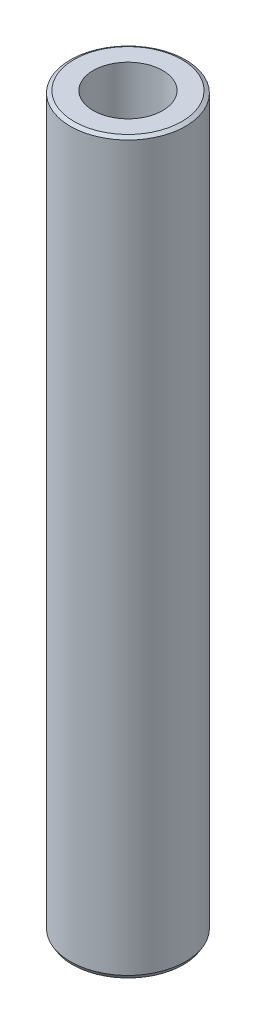
ISO-10303-21;
HEADER;
FILE_DESCRIPTION(('STEP AP214'),'2;1');
FILE_NAME('part.step','',(''),(''),'','','');
FILE_SCHEMA(('AUTOMOTIVE_DESIGN { 1 0 10303 214 1 1 1 1 }'));
ENDSEC;
DATA;
#1=APPLICATION_CONTEXT('core data for automotive mechanical design processes');
#2=APPLICATION_PROTOCOL_DEFINITION('international standard','automotive_design',2000,#1);
#3=PRODUCT_CONTEXT('',#1,'mechanical');
#4=PRODUCT('Part','Part','',(#3));
#5=PRODUCT_RELATED_PRODUCT_CATEGORY('part','',(#4));
#6=PRODUCT_DEFINITION_FORMATION('','',#4);
#7=PRODUCT_DEFINITION_CONTEXT('part definition',#1,'design');
#8=PRODUCT_DEFINITION('design','',#6,#7);
#9=PRODUCT_DEFINITION_SHAPE('','',#8);
#10=(LENGTH_UNIT() NAMED_UNIT(*) SI_UNIT(.MILLI.,.METRE.));
#11=(NAMED_UNIT(*) PLANE_ANGLE_UNIT() SI_UNIT($,.RADIAN.));
#12=(NAMED_UNIT(*) SI_UNIT($,.STERADIAN.) SOLID_ANGLE_UNIT());
#13=UNCERTAINTY_MEASURE_WITH_UNIT(LENGTH_MEASURE(1.E-05),#10,'distance_accuracy_value','');
#14=(GEOMETRIC_REPRESENTATION_CONTEXT(3) GLOBAL_UNCERTAINTY_ASSIGNED_CONTEXT((#13)) GLOBAL_UNIT_ASSIGNED_CONTEXT((#10,
#11,#12)) REPRESENTATION_CONTEXT('',''));
#15=CARTESIAN_POINT('',(0.,0.,0.));
#16=DIRECTION('',(0.,0.,1.));
#17=DIRECTION('',(1.,0.,0.));
#18=AXIS2_PLACEMENT_3D('',#15,#16,#17);
#19=CARTESIAN_POINT('',(0.,348.103230753676,0.));
#20=DIRECTION('',(0.,-1.,0.));
#21=DIRECTION('',(0.,0.,-1.));
#22=AXIS2_PLACEMENT_3D('',#19,#20,#21);
#23=CYLINDRICAL_SURFACE('',#22,27.5);
#24=CARTESIAN_POINT('',(0.,347.058607589924,0.));
#25=DIRECTION('',(0.,1.,0.));
#26=DIRECTION('',(0.,0.,1.));
#27=AXIS2_PLACEMENT_3D('',#24,#25,#26);
#28=CIRCLE('',#27,27.5);
#29=CARTESIAN_POINT('',(0.,347.058607589924,27.5));
#30=VERTEX_POINT('',#29);
#31=EDGE_CURVE('E50',#30,#30,#28,.F.);
#32=ORIENTED_EDGE('',*,*,#31,.T.);
#33=EDGE_LOOP('',(#32));
#34=FACE_BOUND('',#33,.T.);
#35=CARTESIAN_POINT('',(0.,1.80934039438196,0.));
#36=DIRECTION('',(0.,1.,0.));
#37=DIRECTION('',(0.,0.,1.));
#38=AXIS2_PLACEMENT_3D('',#35,#36,#37);
#39=CIRCLE('',#38,27.5);
#40=CARTESIAN_POINT('',(0.,1.80934039438196,27.5));
#41=VERTEX_POINT('',#40);
#42=EDGE_CURVE('E51',#41,#41,#39,.T.);
#43=ORIENTED_EDGE('',*,*,#42,.T.);
#44=EDGE_LOOP('',(#43));
#45=FACE_BOUND('',#44,.T.);
#46=ADVANCED_FACE('F39',(#34,#45),#23,.T.);
#47=CARTESIAN_POINT('',(0.,348.103230753676,0.));
#48=DIRECTION('',(0.,1.,0.));
#49=DIRECTION('',(0.,0.,1.));
#50=AXIS2_PLACEMENT_3D('',#47,#48,#49);
#51=PLANE('',#50);
#52=CARTESIAN_POINT('',(0.,348.103230753676,0.));
#53=DIRECTION('',(0.,1.,0.));
#54=DIRECTION('',(0.,0.,1.));
#55=AXIS2_PLACEMENT_3D('',#52,#53,#54);
#56=CIRCLE('',#55,25.6906596056182);
#57=CARTESIAN_POINT('',(0.,348.103230753676,25.6906596056182));
#58=VERTEX_POINT('',#57);
#59=EDGE_CURVE('E54',#58,#58,#56,.T.);
#60=ORIENTED_EDGE('',*,*,#59,.T.);
#61=EDGE_LOOP('',(#60));
#62=FACE_BOUND('',#61,.T.);
#63=CARTESIAN_POINT('',(0.,348.103230753676,0.));
#64=DIRECTION('',(0.,1.,0.));
#65=DIRECTION('',(0.,0.,1.));
#66=AXIS2_PLACEMENT_3D('',#63,#64,#65);
#67=CIRCLE('',#66,16.5800885978631);
#68=CARTESIAN_POINT('',(0.,348.103230753676,16.5800885978631));
#69=VERTEX_POINT('',#68);
#70=EDGE_CURVE('E58',#69,#69,#67,.T.);
#71=ORIENTED_EDGE('',*,*,#70,.F.);
#72=EDGE_LOOP('',(#71));
#73=FACE_BOUND('',#72,.T.);
#74=ADVANCED_FACE('F69',(#62,#73),#51,.T.);
#75=CARTESIAN_POINT('',(0.,0.,0.));
#76=DIRECTION('',(0.,1.,0.));
#77=DIRECTION('',(0.,0.,1.));
#78=AXIS2_PLACEMENT_3D('',#75,#76,#77);
#79=PLANE('',#78);
#80=CARTESIAN_POINT('',(0.,0.,0.));
#81=DIRECTION('',(0.,1.,0.));
#82=DIRECTION('',(0.,0.,1.));
#83=AXIS2_PLACEMENT_3D('',#80,#81,#82);
#84=CIRCLE('',#83,26.4553768362479);
#85=CARTESIAN_POINT('',(0.,0.,26.4553768362479));
#86=VERTEX_POINT('',#85);
#87=EDGE_CURVE('E10',#86,#86,#84,.F.);
#88=ORIENTED_EDGE('',*,*,#87,.T.);
#89=EDGE_LOOP('',(#88));
#90=FACE_BOUND('',#89,.T.);
#91=CARTESIAN_POINT('',(0.,0.,0.));
#92=DIRECTION('',(0.,1.,0.));
#93=DIRECTION('',(0.,0.,1.));
#94=AXIS2_PLACEMENT_3D('',#91,#92,#93);
#95=CIRCLE('',#94,16.5800885978631);
#96=CARTESIAN_POINT('',(0.,0.,16.5800885978631));
#97=VERTEX_POINT('',#96);
#98=EDGE_CURVE('E63',#97,#97,#95,.T.);
#99=ORIENTED_EDGE('',*,*,#98,.T.);
#100=EDGE_LOOP('',(#99));
#101=FACE_BOUND('',#100,.T.);
#102=ADVANCED_FACE('F75',(#90,#101),#79,.F.);
#103=CARTESIAN_POINT('',(0.,348.103230753676,0.));
#104=DIRECTION('',(0.,-1.,0.));
#105=DIRECTION('',(0.,0.,-1.));
#106=AXIS2_PLACEMENT_3D('',#103,#104,#105);
#107=CYLINDRICAL_SURFACE('',#106,16.5800885978631);
#108=ORIENTED_EDGE('',*,*,#70,.T.);
#109=EDGE_LOOP('',(#108));
#110=FACE_BOUND('',#109,.T.);
#111=ORIENTED_EDGE('',*,*,#98,.F.);
#112=EDGE_LOOP('',(#111));
#113=FACE_BOUND('',#112,.T.);
#114=ADVANCED_FACE('F70',(#110,#113),#107,.F.);
#115=CARTESIAN_POINT('',(0.,348.103230753676,0.));
#116=DIRECTION('',(0.,-1.,0.));
#117=DIRECTION('',(0.,0.,-1.));
#118=AXIS2_PLACEMENT_3D('',#115,#116,#117);
#119=CONICAL_SURFACE('',#118,25.6906596056182,1.04719755119659);
#120=ORIENTED_EDGE('',*,*,#31,.F.);
#121=EDGE_LOOP('',(#120));
#122=FACE_BOUND('',#121,.T.);
#123=ORIENTED_EDGE('',*,*,#59,.F.);
#124=EDGE_LOOP('',(#123));
#125=FACE_BOUND('',#124,.T.);
#126=ADVANCED_FACE('F81',(#122,#125),#119,.T.);
#127=CARTESIAN_POINT('',(0.,1.80934039438196,0.));
#128=DIRECTION('',(0.,1.,0.));
#129=DIRECTION('',(0.,0.,1.));
#130=AXIS2_PLACEMENT_3D('',#127,#128,#129);
#131=CONICAL_SURFACE('',#130,27.5,0.52359877559829);
#132=ORIENTED_EDGE('',*,*,#87,.F.);
#133=EDGE_LOOP('',(#132));
#134=FACE_BOUND('',#133,.T.);
#135=ORIENTED_EDGE('',*,*,#42,.F.);
#136=EDGE_LOOP('',(#135));
#137=FACE_BOUND('',#136,.T.);
#138=ADVANCED_FACE('F45',(#134,#137),#131,.T.);
#139=CLOSED_SHELL('',(#46,#74,#102,#114,#126,#138));
#140=MANIFOLD_SOLID_BREP('B2',#139);
#141=ADVANCED_BREP_SHAPE_REPRESENTATION('',(#18,#140),#14);
#142=SHAPE_DEFINITION_REPRESENTATION(#9,#141);
ENDSEC;
END-ISO-10303-21;
